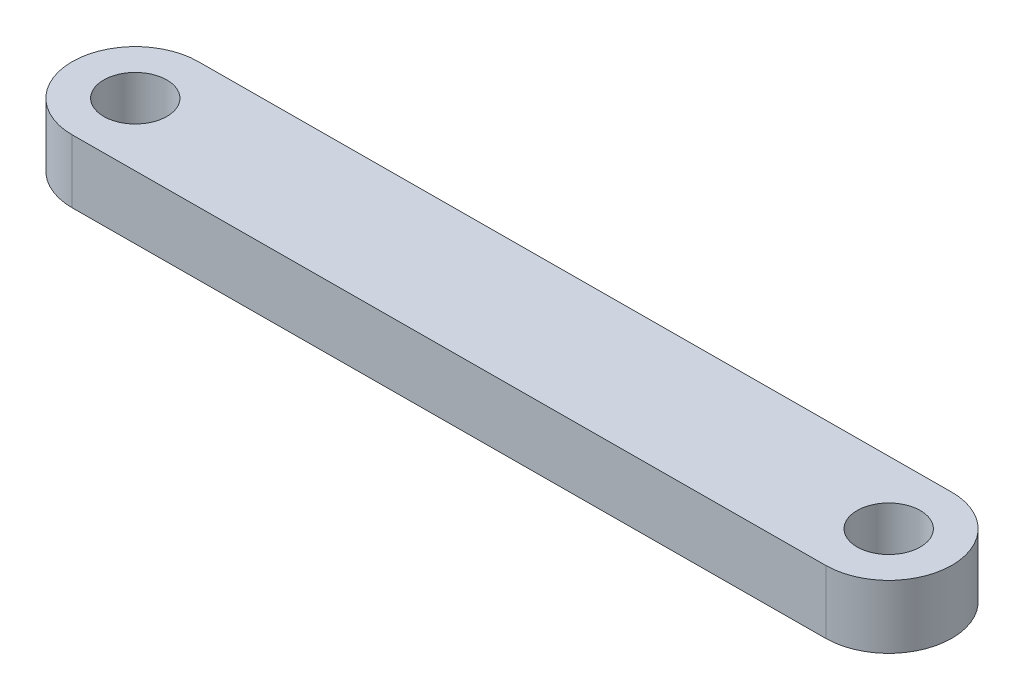
ISO-10303-21;
HEADER;
FILE_DESCRIPTION(('STEP AP214'),'2;1');
FILE_NAME('part.step','',(''),(''),'','','');
FILE_SCHEMA(('AUTOMOTIVE_DESIGN { 1 0 10303 214 1 1 1 1 }'));
ENDSEC;
DATA;
#1=APPLICATION_CONTEXT('core data for automotive mechanical design processes');
#2=APPLICATION_PROTOCOL_DEFINITION('international standard','automotive_design',2000,#1);
#3=PRODUCT_CONTEXT('',#1,'mechanical');
#4=PRODUCT('Part','Part','',(#3));
#5=PRODUCT_RELATED_PRODUCT_CATEGORY('part','',(#4));
#6=PRODUCT_DEFINITION_FORMATION('','',#4);
#7=PRODUCT_DEFINITION_CONTEXT('part definition',#1,'design');
#8=PRODUCT_DEFINITION('design','',#6,#7);
#9=PRODUCT_DEFINITION_SHAPE('','',#8);
#10=(LENGTH_UNIT() NAMED_UNIT(*) SI_UNIT(.MILLI.,.METRE.));
#11=(NAMED_UNIT(*) PLANE_ANGLE_UNIT() SI_UNIT($,.RADIAN.));
#12=(NAMED_UNIT(*) SI_UNIT($,.STERADIAN.) SOLID_ANGLE_UNIT());
#13=UNCERTAINTY_MEASURE_WITH_UNIT(LENGTH_MEASURE(1.E-05),#10,'distance_accuracy_value','');
#14=(GEOMETRIC_REPRESENTATION_CONTEXT(3) GLOBAL_UNCERTAINTY_ASSIGNED_CONTEXT((#13)) GLOBAL_UNIT_ASSIGNED_CONTEXT((#10,
#11,#12)) REPRESENTATION_CONTEXT('',''));
#15=CARTESIAN_POINT('',(0.,0.,0.));
#16=DIRECTION('',(0.,0.,1.));
#17=DIRECTION('',(1.,0.,0.));
#18=AXIS2_PLACEMENT_3D('',#15,#16,#17);
#19=CARTESIAN_POINT('',(0.0131756200733742,3.,2.55046016846377));
#20=DIRECTION('',(-0.00516590865788944,0.,-0.999986656604846));
#21=DIRECTION('',(-0.999986656604846,0.,0.00516590865788944));
#22=AXIS2_PLACEMENT_3D('',#19,#20,#21);
#23=PLANE('',#22);
#24=DIRECTION('',(0.999986656604846,0.,-0.00516590865788944));
#25=VECTOR('',#24,1.);
#26=CARTESIAN_POINT('',(0.0131756200733742,0.,2.55046016846377));
#27=LINE('',#26,#25);
#28=CARTESIAN_POINT('',(-32.1844727523596,0.,2.7167924983926));
#29=VERTEX_POINT('',#28);
#30=CARTESIAN_POINT('',(3.40652229618146,0.,2.53293021558135));
#31=VERTEX_POINT('',#30);
#32=EDGE_CURVE('E112',#29,#31,#27,.T.);
#33=ORIENTED_EDGE('',*,*,#32,.T.);
#34=DIRECTION('',(0.,-1.,0.));
#35=VECTOR('',#34,1.);
#36=CARTESIAN_POINT('',(3.40652229618146,3.,2.53293021558135));
#37=LINE('',#36,#35);
#38=CARTESIAN_POINT('',(3.40652229618146,3.,2.53293021558135));
#39=VERTEX_POINT('',#38);
#40=EDGE_CURVE('E11',#39,#31,#37,.T.);
#41=ORIENTED_EDGE('',*,*,#40,.F.);
#42=DIRECTION('',(0.999986656604846,0.,-0.00516590865788944));
#43=VECTOR('',#42,1.);
#44=CARTESIAN_POINT('',(0.0131756200733742,3.,2.55046016846377));
#45=LINE('',#44,#43);
#46=CARTESIAN_POINT('',(-32.1844727523596,3.,2.7167924983926));
#47=VERTEX_POINT('',#46);
#48=EDGE_CURVE('E91',#47,#39,#45,.T.);
#49=ORIENTED_EDGE('',*,*,#48,.F.);
#50=DIRECTION('',(0.,-1.,0.));
#51=VECTOR('',#50,1.);
#52=CARTESIAN_POINT('',(-32.1844727523596,3.,2.7167924983926));
#53=LINE('',#52,#51);
#54=EDGE_CURVE('E102',#47,#29,#53,.T.);
#55=ORIENTED_EDGE('',*,*,#54,.T.);
#56=EDGE_LOOP('',(#33,#41,#49,#55));
#57=FACE_BOUND('',#56,.T.);
#58=ADVANCED_FACE('F43',(#57),#23,.F.);
#59=CARTESIAN_POINT('',(3.37552724764036,3.,-0.466909664639917));
#60=DIRECTION('',(0.,-1.,0.));
#61=DIRECTION('',(0.,0.,-1.));
#62=AXIS2_PLACEMENT_3D('',#59,#60,#61);
#63=CYLINDRICAL_SURFACE('',#62,2.99999999999996);
#64=CARTESIAN_POINT('',(3.37552724764036,0.,-0.466909664639917));
#65=DIRECTION('',(0.,1.,0.));
#66=DIRECTION('',(0.,0.,1.));
#67=AXIS2_PLACEMENT_3D('',#64,#65,#66);
#68=CIRCLE('',#67,2.99999999999996);
#69=CARTESIAN_POINT('',(3.37552724764036,0.,-3.46690966463992));
#70=VERTEX_POINT('',#69);
#71=EDGE_CURVE('E96',#31,#70,#68,.T.);
#72=ORIENTED_EDGE('',*,*,#71,.T.);
#73=DIRECTION('',(0.,-1.,0.));
#74=VECTOR('',#73,1.);
#75=CARTESIAN_POINT('',(3.37552724764036,3.,-3.46690966463992));
#76=LINE('',#75,#74);
#77=CARTESIAN_POINT('',(3.37552724764036,3.,-3.46690966463992));
#78=VERTEX_POINT('',#77);
#79=EDGE_CURVE('E52',#78,#70,#76,.T.);
#80=ORIENTED_EDGE('',*,*,#79,.F.);
#81=CARTESIAN_POINT('',(3.37552724764036,3.,-0.466909664639917));
#82=DIRECTION('',(0.,1.,0.));
#83=DIRECTION('',(0.,0.,1.));
#84=AXIS2_PLACEMENT_3D('',#81,#82,#83);
#85=CIRCLE('',#84,2.99999999999996);
#86=EDGE_CURVE('E86',#39,#78,#85,.T.);
#87=ORIENTED_EDGE('',*,*,#86,.F.);
#88=ORIENTED_EDGE('',*,*,#40,.T.);
#89=EDGE_LOOP('',(#72,#80,#87,#88));
#90=FACE_BOUND('',#89,.T.);
#91=ADVANCED_FACE('F95',(#90),#63,.T.);
#92=CARTESIAN_POINT('',(-0.0178194182840529,3.,-3.44937971181513));
#93=DIRECTION('',(-0.00516590865641078,0.,-0.999986656604854));
#94=DIRECTION('',(-0.999986656604854,0.,0.00516590865641078));
#95=AXIS2_PLACEMENT_3D('',#92,#93,#94);
#96=PLANE('',#95);
#97=DIRECTION('',(0.999986656604854,0.,-0.00516590865641078));
#98=VECTOR('',#97,1.);
#99=CARTESIAN_POINT('',(-0.0178194182840529,0.,-3.44937971181513));
#100=LINE('',#99,#98);
#101=CARTESIAN_POINT('',(-32.1844727523596,0.,-3.2832075016074));
#102=VERTEX_POINT('',#101);
#103=EDGE_CURVE('E116',#102,#70,#100,.T.);
#104=ORIENTED_EDGE('',*,*,#103,.F.);
#105=DIRECTION('',(0.,-1.,0.));
#106=VECTOR('',#105,1.);
#107=CARTESIAN_POINT('',(-32.1844727523596,3.,-3.2832075016074));
#108=LINE('',#107,#106);
#109=CARTESIAN_POINT('',(-32.1844727523596,3.,-3.2832075016074));
#110=VERTEX_POINT('',#109);
#111=EDGE_CURVE('E76',#110,#102,#108,.T.);
#112=ORIENTED_EDGE('',*,*,#111,.F.);
#113=DIRECTION('',(0.999986656604854,0.,-0.00516590865641078));
#114=VECTOR('',#113,1.);
#115=CARTESIAN_POINT('',(-0.0178194182840529,3.,-3.44937971181513));
#116=LINE('',#115,#114);
#117=EDGE_CURVE('E89',#110,#78,#116,.T.);
#118=ORIENTED_EDGE('',*,*,#117,.T.);
#119=ORIENTED_EDGE('',*,*,#79,.T.);
#120=EDGE_LOOP('',(#104,#112,#118,#119));
#121=FACE_BOUND('',#120,.T.);
#122=ADVANCED_FACE('F100',(#121),#96,.T.);
#123=CARTESIAN_POINT('',(3.37552724764036,3.,-0.466909664639917));
#124=DIRECTION('',(0.,-1.,0.));
#125=DIRECTION('',(0.,0.,-1.));
#126=AXIS2_PLACEMENT_3D('',#123,#124,#125);
#127=CYLINDRICAL_SURFACE('',#126,1.49999999999991);
#128=CARTESIAN_POINT('',(3.37552724764036,3.,-0.466909664639917));
#129=DIRECTION('',(0.,1.,0.));
#130=DIRECTION('',(0.,0.,1.));
#131=AXIS2_PLACEMENT_3D('',#128,#129,#130);
#132=CIRCLE('',#131,1.49999999999991);
#133=CARTESIAN_POINT('',(3.37552724764036,3.,1.03309033535999));
#134=VERTEX_POINT('',#133);
#135=EDGE_CURVE('E154',#134,#134,#132,.T.);
#136=ORIENTED_EDGE('',*,*,#135,.T.);
#137=EDGE_LOOP('',(#136));
#138=FACE_BOUND('',#137,.T.);
#139=CARTESIAN_POINT('',(3.37552724764036,0.,-0.466909664639917));
#140=DIRECTION('',(0.,1.,0.));
#141=DIRECTION('',(0.,0.,1.));
#142=AXIS2_PLACEMENT_3D('',#139,#140,#141);
#143=CIRCLE('',#142,1.49999999999991);
#144=CARTESIAN_POINT('',(3.37552724764036,0.,1.03309033535999));
#145=VERTEX_POINT('',#144);
#146=EDGE_CURVE('E109',#145,#145,#143,.T.);
#147=ORIENTED_EDGE('',*,*,#146,.F.);
#148=EDGE_LOOP('',(#147));
#149=FACE_BOUND('',#148,.T.);
#150=ADVANCED_FACE('F143',(#138,#149),#127,.F.);
#151=CARTESIAN_POINT('',(-32.1844727523596,3.,-0.283207501607399));
#152=DIRECTION('',(0.,-1.,0.));
#153=DIRECTION('',(0.,0.,-1.));
#154=AXIS2_PLACEMENT_3D('',#151,#152,#153);
#155=CYLINDRICAL_SURFACE('',#154,1.4999999999694);
#156=CARTESIAN_POINT('',(-32.1844727523596,3.,-0.283207501607399));
#157=DIRECTION('',(0.,1.,0.));
#158=DIRECTION('',(0.,0.,1.));
#159=AXIS2_PLACEMENT_3D('',#156,#157,#158);
#160=CIRCLE('',#159,1.4999999999694);
#161=CARTESIAN_POINT('',(-32.1844727523596,3.,1.216792498362));
#162=VERTEX_POINT('',#161);
#163=EDGE_CURVE('E119',#162,#162,#160,.T.);
#164=ORIENTED_EDGE('',*,*,#163,.T.);
#165=EDGE_LOOP('',(#164));
#166=FACE_BOUND('',#165,.T.);
#167=CARTESIAN_POINT('',(-32.1844727523596,0.,-0.283207501607399));
#168=DIRECTION('',(0.,1.,0.));
#169=DIRECTION('',(0.,0.,1.));
#170=AXIS2_PLACEMENT_3D('',#167,#168,#169);
#171=CIRCLE('',#170,1.4999999999694);
#172=CARTESIAN_POINT('',(-32.1844727523596,0.,1.216792498362));
#173=VERTEX_POINT('',#172);
#174=EDGE_CURVE('E106',#173,#173,#171,.T.);
#175=ORIENTED_EDGE('',*,*,#174,.F.);
#176=EDGE_LOOP('',(#175));
#177=FACE_BOUND('',#176,.T.);
#178=ADVANCED_FACE('F45',(#166,#177),#155,.F.);
#179=CARTESIAN_POINT('',(-32.1844727523596,3.,-0.283207501607399));
#180=DIRECTION('',(0.,-1.,0.));
#181=DIRECTION('',(0.,0.,-1.));
#182=AXIS2_PLACEMENT_3D('',#179,#180,#181);
#183=CYLINDRICAL_SURFACE('',#182,3.);
#184=CARTESIAN_POINT('',(-32.1844727523596,0.,-0.283207501607399));
#185=DIRECTION('',(0.,1.,0.));
#186=DIRECTION('',(0.,0.,1.));
#187=AXIS2_PLACEMENT_3D('',#184,#185,#186);
#188=CIRCLE('',#187,3.);
#189=EDGE_CURVE('E79',#102,#29,#188,.T.);
#190=ORIENTED_EDGE('',*,*,#189,.T.);
#191=ORIENTED_EDGE('',*,*,#54,.F.);
#192=CARTESIAN_POINT('',(-32.1844727523596,3.,-0.283207501607399));
#193=DIRECTION('',(0.,1.,0.));
#194=DIRECTION('',(0.,0.,1.));
#195=AXIS2_PLACEMENT_3D('',#192,#193,#194);
#196=CIRCLE('',#195,3.);
#197=EDGE_CURVE('E60',#110,#47,#196,.T.);
#198=ORIENTED_EDGE('',*,*,#197,.F.);
#199=ORIENTED_EDGE('',*,*,#111,.T.);
#200=EDGE_LOOP('',(#190,#191,#198,#199));
#201=FACE_BOUND('',#200,.T.);
#202=ADVANCED_FACE('F131',(#201),#183,.T.);
#203=CARTESIAN_POINT('',(0.,3.,0.));
#204=DIRECTION('',(0.,1.,0.));
#205=DIRECTION('',(0.,0.,1.));
#206=AXIS2_PLACEMENT_3D('',#203,#204,#205);
#207=PLANE('',#206);
#208=ORIENTED_EDGE('',*,*,#163,.F.);
#209=EDGE_LOOP('',(#208));
#210=FACE_BOUND('',#209,.T.);
#211=ORIENTED_EDGE('',*,*,#135,.F.);
#212=EDGE_LOOP('',(#211));
#213=FACE_BOUND('',#212,.T.);
#214=ORIENTED_EDGE('',*,*,#48,.T.);
#215=ORIENTED_EDGE('',*,*,#86,.T.);
#216=ORIENTED_EDGE('',*,*,#117,.F.);
#217=ORIENTED_EDGE('',*,*,#197,.T.);
#218=EDGE_LOOP('',(#214,#215,#216,#217));
#219=FACE_BOUND('',#218,.T.);
#220=ADVANCED_FACE('F87',(#210,#213,#219),#207,.T.);
#221=CARTESIAN_POINT('',(0.,0.,0.));
#222=DIRECTION('',(0.,1.,0.));
#223=DIRECTION('',(0.,0.,1.));
#224=AXIS2_PLACEMENT_3D('',#221,#222,#223);
#225=PLANE('',#224);
#226=ORIENTED_EDGE('',*,*,#174,.T.);
#227=EDGE_LOOP('',(#226));
#228=FACE_BOUND('',#227,.T.);
#229=ORIENTED_EDGE('',*,*,#146,.T.);
#230=EDGE_LOOP('',(#229));
#231=FACE_BOUND('',#230,.T.);
#232=ORIENTED_EDGE('',*,*,#32,.F.);
#233=ORIENTED_EDGE('',*,*,#189,.F.);
#234=ORIENTED_EDGE('',*,*,#103,.T.);
#235=ORIENTED_EDGE('',*,*,#71,.F.);
#236=EDGE_LOOP('',(#232,#233,#234,#235));
#237=FACE_BOUND('',#236,.T.);
#238=ADVANCED_FACE('F124',(#228,#231,#237),#225,.F.);
#239=CLOSED_SHELL('',(#58,#91,#122,#150,#178,#202,#220,#238));
#240=MANIFOLD_SOLID_BREP('B2',#239);
#241=ADVANCED_BREP_SHAPE_REPRESENTATION('',(#18,#240),#14);
#242=SHAPE_DEFINITION_REPRESENTATION(#9,#241);
ENDSEC;
END-ISO-10303-21;
